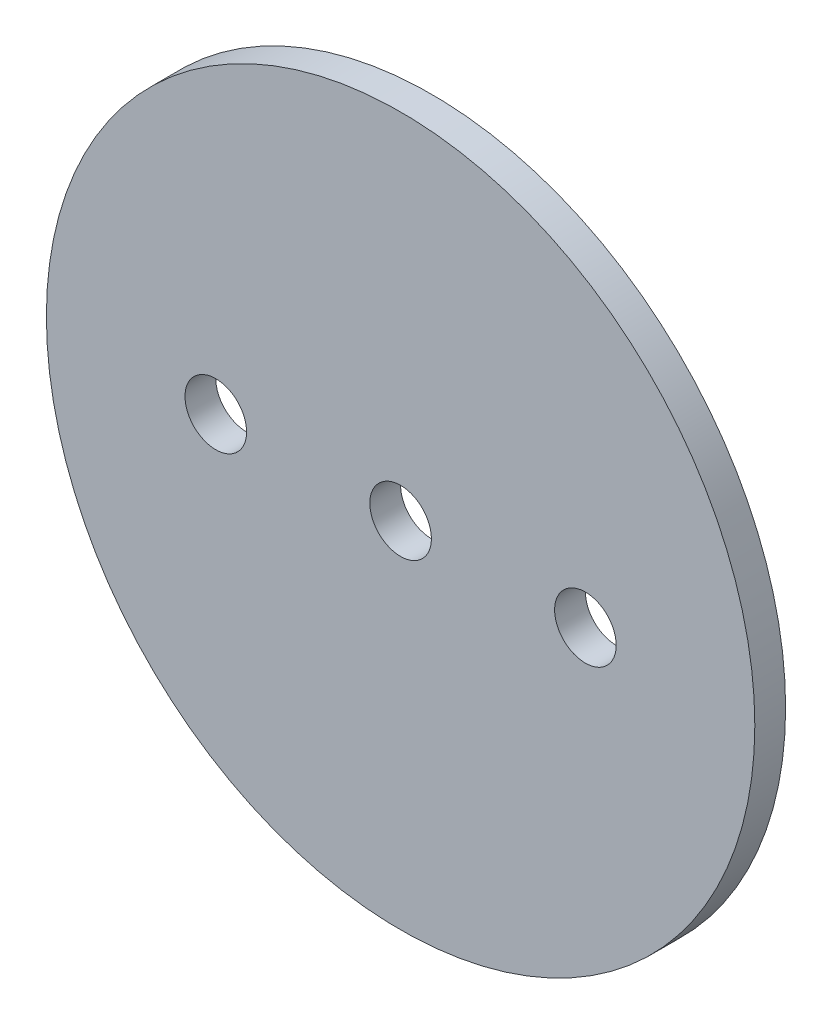
ISO-10303-21;
HEADER;
FILE_DESCRIPTION(('STEP AP214'),'2;1');
FILE_NAME('part.step','',(''),(''),'','','');
FILE_SCHEMA(('AUTOMOTIVE_DESIGN { 1 0 10303 214 1 1 1 1 }'));
ENDSEC;
DATA;
#1=APPLICATION_CONTEXT('core data for automotive mechanical design processes');
#2=APPLICATION_PROTOCOL_DEFINITION('international standard','automotive_design',2000,#1);
#3=PRODUCT_CONTEXT('',#1,'mechanical');
#4=PRODUCT('Part','Part','',(#3));
#5=PRODUCT_RELATED_PRODUCT_CATEGORY('part','',(#4));
#6=PRODUCT_DEFINITION_FORMATION('','',#4);
#7=PRODUCT_DEFINITION_CONTEXT('part definition',#1,'design');
#8=PRODUCT_DEFINITION('design','',#6,#7);
#9=PRODUCT_DEFINITION_SHAPE('','',#8);
#10=(LENGTH_UNIT() NAMED_UNIT(*) SI_UNIT(.MILLI.,.METRE.));
#11=(NAMED_UNIT(*) PLANE_ANGLE_UNIT() SI_UNIT($,.RADIAN.));
#12=(NAMED_UNIT(*) SI_UNIT($,.STERADIAN.) SOLID_ANGLE_UNIT());
#13=UNCERTAINTY_MEASURE_WITH_UNIT(LENGTH_MEASURE(1.E-05),#10,'distance_accuracy_value','');
#14=(GEOMETRIC_REPRESENTATION_CONTEXT(3) GLOBAL_UNCERTAINTY_ASSIGNED_CONTEXT((#13)) GLOBAL_UNIT_ASSIGNED_CONTEXT((#10,
#11,#12)) REPRESENTATION_CONTEXT('',''));
#15=CARTESIAN_POINT('',(0.,0.,0.));
#16=DIRECTION('',(0.,0.,1.));
#17=DIRECTION('',(1.,0.,0.));
#18=AXIS2_PLACEMENT_3D('',#15,#16,#17);
#19=CARTESIAN_POINT('',(0.,0.,1.5875));
#20=DIRECTION('',(0.,0.,-1.));
#21=DIRECTION('',(-1.,0.,0.));
#22=AXIS2_PLACEMENT_3D('',#19,#20,#21);
#23=CYLINDRICAL_SURFACE('',#22,36.5125);
#24=CARTESIAN_POINT('',(0.,0.,1.5875));
#25=DIRECTION('',(0.,0.,1.));
#26=DIRECTION('',(1.,0.,0.));
#27=AXIS2_PLACEMENT_3D('',#24,#25,#26);
#28=CIRCLE('',#27,36.5125);
#29=CARTESIAN_POINT('',(36.5125,0.,1.5875));
#30=VERTEX_POINT('',#29);
#31=EDGE_CURVE('E10',#30,#30,#28,.T.);
#32=ORIENTED_EDGE('',*,*,#31,.F.);
#33=EDGE_LOOP('',(#32));
#34=FACE_BOUND('',#33,.T.);
#35=CARTESIAN_POINT('',(0.,0.,-1.5875));
#36=DIRECTION('',(0.,0.,1.));
#37=DIRECTION('',(1.,0.,0.));
#38=AXIS2_PLACEMENT_3D('',#35,#36,#37);
#39=CIRCLE('',#38,36.5125);
#40=CARTESIAN_POINT('',(36.5125,0.,-1.5875));
#41=VERTEX_POINT('',#40);
#42=EDGE_CURVE('E40',#41,#41,#39,.T.);
#43=ORIENTED_EDGE('',*,*,#42,.T.);
#44=EDGE_LOOP('',(#43));
#45=FACE_BOUND('',#44,.T.);
#46=ADVANCED_FACE('F37',(#34,#45),#23,.T.);
#47=CARTESIAN_POINT('',(0.,0.,1.5875));
#48=DIRECTION('',(0.,0.,1.));
#49=DIRECTION('',(1.,0.,0.));
#50=AXIS2_PLACEMENT_3D('',#47,#48,#49);
#51=PLANE('',#50);
#52=CARTESIAN_POINT('',(0.,0.,1.5875));
#53=DIRECTION('',(0.,0.,1.));
#54=DIRECTION('',(1.,0.,0.));
#55=AXIS2_PLACEMENT_3D('',#52,#53,#54);
#56=CIRCLE('',#55,3.17499999999999);
#57=CARTESIAN_POINT('',(3.17499999999999,0.,1.5875));
#58=VERTEX_POINT('',#57);
#59=EDGE_CURVE('E63',#58,#58,#56,.T.);
#60=ORIENTED_EDGE('',*,*,#59,.F.);
#61=EDGE_LOOP('',(#60));
#62=FACE_BOUND('',#61,.T.);
#63=CARTESIAN_POINT('',(19.05,0.,1.5875));
#64=DIRECTION('',(0.,0.,1.));
#65=DIRECTION('',(1.,0.,0.));
#66=AXIS2_PLACEMENT_3D('',#63,#64,#65);
#67=CIRCLE('',#66,3.17499999999999);
#68=CARTESIAN_POINT('',(22.225,0.,1.5875));
#69=VERTEX_POINT('',#68);
#70=EDGE_CURVE('E57',#69,#69,#67,.T.);
#71=ORIENTED_EDGE('',*,*,#70,.F.);
#72=EDGE_LOOP('',(#71));
#73=FACE_BOUND('',#72,.T.);
#74=CARTESIAN_POINT('',(-19.05,0.,1.5875));
#75=DIRECTION('',(0.,0.,1.));
#76=DIRECTION('',(1.,0.,0.));
#77=AXIS2_PLACEMENT_3D('',#74,#75,#76);
#78=CIRCLE('',#77,3.17499999999999);
#79=CARTESIAN_POINT('',(-15.875,0.,1.5875));
#80=VERTEX_POINT('',#79);
#81=EDGE_CURVE('E51',#80,#80,#78,.T.);
#82=ORIENTED_EDGE('',*,*,#81,.F.);
#83=EDGE_LOOP('',(#82));
#84=FACE_BOUND('',#83,.T.);
#85=ORIENTED_EDGE('',*,*,#31,.T.);
#86=EDGE_LOOP('',(#85));
#87=FACE_BOUND('',#86,.T.);
#88=ADVANCED_FACE('F69',(#62,#73,#84,#87),#51,.T.);
#89=CARTESIAN_POINT('',(0.,0.,-1.5875));
#90=DIRECTION('',(0.,0.,1.));
#91=DIRECTION('',(1.,0.,0.));
#92=AXIS2_PLACEMENT_3D('',#89,#90,#91);
#93=PLANE('',#92);
#94=CARTESIAN_POINT('',(0.,0.,-1.5875));
#95=DIRECTION('',(0.,0.,1.));
#96=DIRECTION('',(1.,0.,0.));
#97=AXIS2_PLACEMENT_3D('',#94,#95,#96);
#98=CIRCLE('',#97,3.17499999999999);
#99=CARTESIAN_POINT('',(3.17499999999999,0.,-1.5875));
#100=VERTEX_POINT('',#99);
#101=EDGE_CURVE('E60',#100,#100,#98,.T.);
#102=ORIENTED_EDGE('',*,*,#101,.T.);
#103=EDGE_LOOP('',(#102));
#104=FACE_BOUND('',#103,.T.);
#105=CARTESIAN_POINT('',(19.05,0.,-1.5875));
#106=DIRECTION('',(0.,0.,1.));
#107=DIRECTION('',(1.,0.,0.));
#108=AXIS2_PLACEMENT_3D('',#105,#106,#107);
#109=CIRCLE('',#108,3.17499999999999);
#110=CARTESIAN_POINT('',(22.225,0.,-1.5875));
#111=VERTEX_POINT('',#110);
#112=EDGE_CURVE('E54',#111,#111,#109,.T.);
#113=ORIENTED_EDGE('',*,*,#112,.T.);
#114=EDGE_LOOP('',(#113));
#115=FACE_BOUND('',#114,.T.);
#116=CARTESIAN_POINT('',(-19.05,0.,-1.5875));
#117=DIRECTION('',(0.,0.,1.));
#118=DIRECTION('',(1.,0.,0.));
#119=AXIS2_PLACEMENT_3D('',#116,#117,#118);
#120=CIRCLE('',#119,3.17499999999999);
#121=CARTESIAN_POINT('',(-15.875,0.,-1.5875));
#122=VERTEX_POINT('',#121);
#123=EDGE_CURVE('E47',#122,#122,#120,.T.);
#124=ORIENTED_EDGE('',*,*,#123,.T.);
#125=EDGE_LOOP('',(#124));
#126=FACE_BOUND('',#125,.T.);
#127=ORIENTED_EDGE('',*,*,#42,.F.);
#128=EDGE_LOOP('',(#127));
#129=FACE_BOUND('',#128,.T.);
#130=ADVANCED_FACE('F72',(#104,#115,#126,#129),#93,.F.);
#131=CARTESIAN_POINT('',(-19.05,0.,1.5875));
#132=DIRECTION('',(0.,0.,1.));
#133=DIRECTION('',(1.,0.,0.));
#134=AXIS2_PLACEMENT_3D('',#131,#132,#133);
#135=CYLINDRICAL_SURFACE('',#134,3.17499999999999);
#136=ORIENTED_EDGE('',*,*,#123,.F.);
#137=EDGE_LOOP('',(#136));
#138=FACE_BOUND('',#137,.T.);
#139=ORIENTED_EDGE('',*,*,#81,.T.);
#140=EDGE_LOOP('',(#139));
#141=FACE_BOUND('',#140,.T.);
#142=ADVANCED_FACE('F78',(#138,#141),#135,.F.);
#143=CARTESIAN_POINT('',(19.05,0.,1.5875));
#144=DIRECTION('',(0.,0.,1.));
#145=DIRECTION('',(1.,0.,0.));
#146=AXIS2_PLACEMENT_3D('',#143,#144,#145);
#147=CYLINDRICAL_SURFACE('',#146,3.17499999999999);
#148=ORIENTED_EDGE('',*,*,#112,.F.);
#149=EDGE_LOOP('',(#148));
#150=FACE_BOUND('',#149,.T.);
#151=ORIENTED_EDGE('',*,*,#70,.T.);
#152=EDGE_LOOP('',(#151));
#153=FACE_BOUND('',#152,.T.);
#154=ADVANCED_FACE('F80',(#150,#153),#147,.F.);
#155=CARTESIAN_POINT('',(0.,0.,1.5875));
#156=DIRECTION('',(0.,0.,1.));
#157=DIRECTION('',(1.,0.,0.));
#158=AXIS2_PLACEMENT_3D('',#155,#156,#157);
#159=CYLINDRICAL_SURFACE('',#158,3.17499999999999);
#160=ORIENTED_EDGE('',*,*,#101,.F.);
#161=EDGE_LOOP('',(#160));
#162=FACE_BOUND('',#161,.T.);
#163=ORIENTED_EDGE('',*,*,#59,.T.);
#164=EDGE_LOOP('',(#163));
#165=FACE_BOUND('',#164,.T.);
#166=ADVANCED_FACE('F67',(#162,#165),#159,.F.);
#167=CLOSED_SHELL('',(#46,#88,#130,#142,#154,#166));
#168=MANIFOLD_SOLID_BREP('B2',#167);
#169=ADVANCED_BREP_SHAPE_REPRESENTATION('',(#18,#168),#14);
#170=SHAPE_DEFINITION_REPRESENTATION(#9,#169);
ENDSEC;
END-ISO-10303-21;
